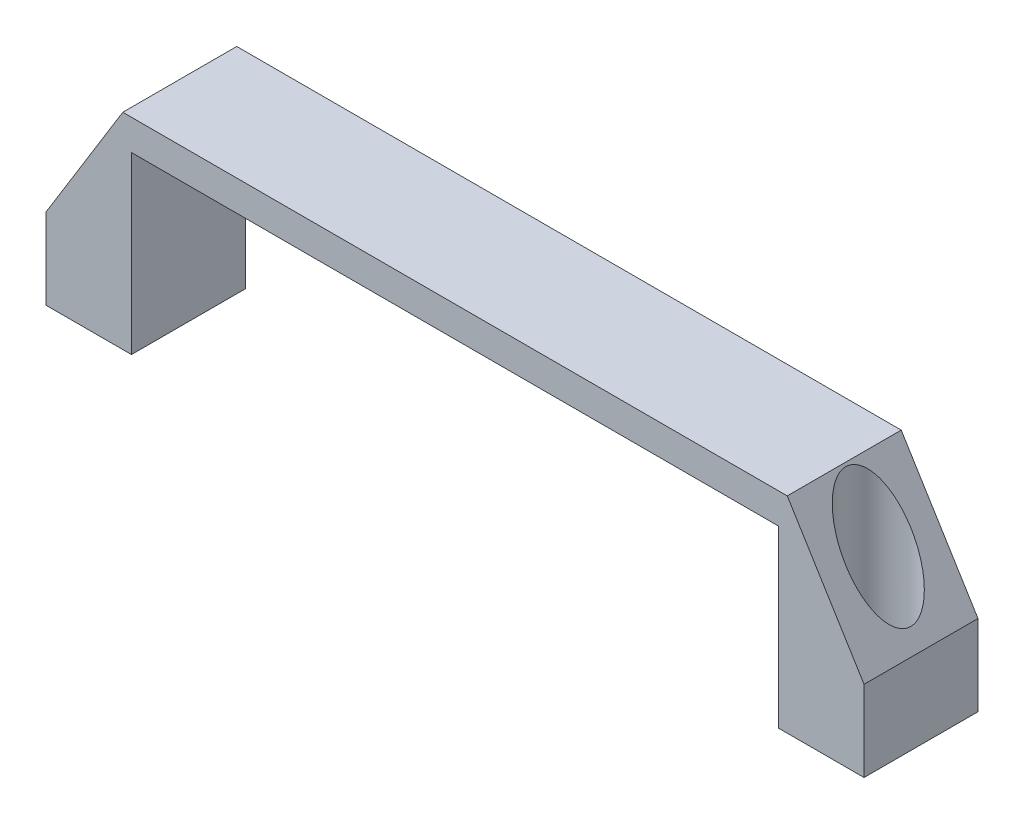
ISO-10303-21;
HEADER;
FILE_DESCRIPTION(('STEP AP214'),'2;1');
FILE_NAME('part.step','',(''),(''),'','','');
FILE_SCHEMA(('AUTOMOTIVE_DESIGN { 1 0 10303 214 1 1 1 1 }'));
ENDSEC;
DATA;
#1=APPLICATION_CONTEXT('core data for automotive mechanical design processes');
#2=APPLICATION_PROTOCOL_DEFINITION('international standard','automotive_design',2000,#1);
#3=PRODUCT_CONTEXT('',#1,'mechanical');
#4=PRODUCT('Part','Part','',(#3));
#5=PRODUCT_RELATED_PRODUCT_CATEGORY('part','',(#4));
#6=PRODUCT_DEFINITION_FORMATION('','',#4);
#7=PRODUCT_DEFINITION_CONTEXT('part definition',#1,'design');
#8=PRODUCT_DEFINITION('design','',#6,#7);
#9=PRODUCT_DEFINITION_SHAPE('','',#8);
#10=(LENGTH_UNIT() NAMED_UNIT(*) SI_UNIT(.MILLI.,.METRE.));
#11=(NAMED_UNIT(*) PLANE_ANGLE_UNIT() SI_UNIT($,.RADIAN.));
#12=(NAMED_UNIT(*) SI_UNIT($,.STERADIAN.) SOLID_ANGLE_UNIT());
#13=UNCERTAINTY_MEASURE_WITH_UNIT(LENGTH_MEASURE(1.E-05),#10,'distance_accuracy_value','');
#14=(GEOMETRIC_REPRESENTATION_CONTEXT(3) GLOBAL_UNCERTAINTY_ASSIGNED_CONTEXT((#13)) GLOBAL_UNIT_ASSIGNED_CONTEXT((#10,
#11,#12)) REPRESENTATION_CONTEXT('',''));
#15=CARTESIAN_POINT('',(0.,0.,0.));
#16=DIRECTION('',(0.,0.,1.));
#17=DIRECTION('',(1.,0.,0.));
#18=AXIS2_PLACEMENT_3D('',#15,#16,#17);
#19=CARTESIAN_POINT('',(-90.,7.50834742871663,0.));
#20=DIRECTION('',(0.,-1.,0.));
#21=DIRECTION('',(0.,0.,-1.));
#22=AXIS2_PLACEMENT_3D('',#19,#20,#21);
#23=CYLINDRICAL_SURFACE('',#22,4.25000000000001);
#24=CARTESIAN_POINT('',(-90.,-42.9916525712834,0.));
#25=DIRECTION('',(0.,-1.,0.));
#26=DIRECTION('',(0.,0.,-1.));
#27=AXIS2_PLACEMENT_3D('',#24,#25,#26);
#28=CIRCLE('',#27,4.25000000000001);
#29=CARTESIAN_POINT('',(-90.,-42.9916525712834,-4.25000000000001));
#30=VERTEX_POINT('',#29);
#31=EDGE_CURVE('E149',#30,#30,#28,.T.);
#32=ORIENTED_EDGE('',*,*,#31,.T.);
#33=EDGE_LOOP('',(#32));
#34=FACE_BOUND('',#33,.T.);
#35=CARTESIAN_POINT('',(-90.,-38.4916525712834,0.));
#36=DIRECTION('',(0.,1.,0.));
#37=DIRECTION('',(-1.,0.,0.));
#38=AXIS2_PLACEMENT_3D('',#35,#36,#37);
#39=CIRCLE('',#38,4.25000000000001);
#40=CARTESIAN_POINT('',(-94.25,-38.4916525712834,0.));
#41=VERTEX_POINT('',#40);
#42=EDGE_CURVE('E182',#41,#41,#39,.F.);
#43=ORIENTED_EDGE('',*,*,#42,.F.);
#44=EDGE_LOOP('',(#43));
#45=FACE_BOUND('',#44,.T.);
#46=ADVANCED_FACE('F34',(#34,#45),#23,.F.);
#47=CARTESIAN_POINT('',(-100.5,-42.9916525712834,14.));
#48=DIRECTION('',(1.,0.,0.));
#49=DIRECTION('',(0.,0.,-1.));
#50=AXIS2_PLACEMENT_3D('',#47,#48,#49);
#51=PLANE('',#50);
#52=DIRECTION('',(0.,-1.,0.));
#53=VECTOR('',#52,1.);
#54=CARTESIAN_POINT('',(-100.5,-42.9916525712834,-14.));
#55=LINE('',#54,#53);
#56=CARTESIAN_POINT('',(-100.5,-23.1511573142438,-14.));
#57=VERTEX_POINT('',#56);
#58=CARTESIAN_POINT('',(-100.5,-42.9916525712834,-14.));
#59=VERTEX_POINT('',#58);
#60=EDGE_CURVE('E145',#57,#59,#55,.T.);
#61=ORIENTED_EDGE('',*,*,#60,.T.);
#62=DIRECTION('',(0.,0.,-1.));
#63=VECTOR('',#62,1.);
#64=CARTESIAN_POINT('',(-100.5,-42.9916525712834,14.));
#65=LINE('',#64,#63);
#66=CARTESIAN_POINT('',(-100.5,-42.9916525712834,14.));
#67=VERTEX_POINT('',#66);
#68=EDGE_CURVE('E11',#67,#59,#65,.T.);
#69=ORIENTED_EDGE('',*,*,#68,.F.);
#70=DIRECTION('',(0.,-1.,0.));
#71=VECTOR('',#70,1.);
#72=CARTESIAN_POINT('',(-100.5,-42.9916525712834,14.));
#73=LINE('',#72,#71);
#74=CARTESIAN_POINT('',(-100.5,-23.1511573142438,14.));
#75=VERTEX_POINT('',#74);
#76=EDGE_CURVE('E164',#75,#67,#73,.T.);
#77=ORIENTED_EDGE('',*,*,#76,.F.);
#78=DIRECTION('',(0.,0.,-1.));
#79=VECTOR('',#78,1.);
#80=CARTESIAN_POINT('',(-100.5,-23.1511573142438,14.));
#81=LINE('',#80,#79);
#82=EDGE_CURVE('E141',#75,#57,#81,.T.);
#83=ORIENTED_EDGE('',*,*,#82,.T.);
#84=EDGE_LOOP('',(#61,#69,#77,#83));
#85=FACE_BOUND('',#84,.T.);
#86=ADVANCED_FACE('F36',(#85),#51,.F.);
#87=CARTESIAN_POINT('',(-100.5,-42.9916525712834,14.));
#88=DIRECTION('',(0.,1.,0.));
#89=DIRECTION('',(0.,0.,1.));
#90=AXIS2_PLACEMENT_3D('',#87,#88,#89);
#91=PLANE('',#90);
#92=ORIENTED_EDGE('',*,*,#31,.F.);
#93=EDGE_LOOP('',(#92));
#94=FACE_BOUND('',#93,.T.);
#95=DIRECTION('',(1.,0.,0.));
#96=VECTOR('',#95,1.);
#97=CARTESIAN_POINT('',(-100.5,-42.9916525712834,-14.));
#98=LINE('',#97,#96);
#99=CARTESIAN_POINT('',(-79.5,-42.9916525712834,-14.));
#100=VERTEX_POINT('',#99);
#101=EDGE_CURVE('E148',#59,#100,#98,.T.);
#102=ORIENTED_EDGE('',*,*,#101,.T.);
#103=DIRECTION('',(0.,0.,-1.));
#104=VECTOR('',#103,1.);
#105=CARTESIAN_POINT('',(-79.5,-42.9916525712834,14.));
#106=LINE('',#105,#104);
#107=CARTESIAN_POINT('',(-79.5,-42.9916525712834,14.));
#108=VERTEX_POINT('',#107);
#109=EDGE_CURVE('E44',#108,#100,#106,.T.);
#110=ORIENTED_EDGE('',*,*,#109,.F.);
#111=DIRECTION('',(1.,0.,0.));
#112=VECTOR('',#111,1.);
#113=CARTESIAN_POINT('',(-100.5,-42.9916525712834,14.));
#114=LINE('',#113,#112);
#115=EDGE_CURVE('E102',#67,#108,#114,.T.);
#116=ORIENTED_EDGE('',*,*,#115,.F.);
#117=ORIENTED_EDGE('',*,*,#68,.T.);
#118=EDGE_LOOP('',(#102,#110,#116,#117));
#119=FACE_BOUND('',#118,.T.);
#120=ADVANCED_FACE('F249',(#94,#119),#91,.F.);
#121=CARTESIAN_POINT('',(-79.5,-42.9916525712834,14.));
#122=DIRECTION('',(-1.,0.,0.));
#123=DIRECTION('',(0.,0.,1.));
#124=AXIS2_PLACEMENT_3D('',#121,#122,#123);
#125=PLANE('',#124);
#126=DIRECTION('',(0.,1.,0.));
#127=VECTOR('',#126,1.);
#128=CARTESIAN_POINT('',(-79.5,-42.9916525712834,-14.));
#129=LINE('',#128,#127);
#130=CARTESIAN_POINT('',(-79.5,0.00834742871660965,-14.));
#131=VERTEX_POINT('',#130);
#132=EDGE_CURVE('E151',#100,#131,#129,.T.);
#133=ORIENTED_EDGE('',*,*,#132,.T.);
#134=DIRECTION('',(0.,0.,-1.));
#135=VECTOR('',#134,1.);
#136=CARTESIAN_POINT('',(-79.5,0.00834742871660965,14.));
#137=LINE('',#136,#135);
#138=CARTESIAN_POINT('',(-79.5,0.00834742871660965,14.));
#139=VERTEX_POINT('',#138);
#140=EDGE_CURVE('E177',#139,#131,#137,.T.);
#141=ORIENTED_EDGE('',*,*,#140,.F.);
#142=DIRECTION('',(0.,1.,0.));
#143=VECTOR('',#142,1.);
#144=CARTESIAN_POINT('',(-79.5,-42.9916525712834,14.));
#145=LINE('',#144,#143);
#146=EDGE_CURVE('E208',#108,#139,#145,.T.);
#147=ORIENTED_EDGE('',*,*,#146,.F.);
#148=ORIENTED_EDGE('',*,*,#109,.T.);
#149=EDGE_LOOP('',(#133,#141,#147,#148));
#150=FACE_BOUND('',#149,.T.);
#151=ADVANCED_FACE('F282',(#150),#125,.F.);
#152=CARTESIAN_POINT('',(-79.5,0.00834742871660965,14.));
#153=DIRECTION('',(0.,1.,0.));
#154=DIRECTION('',(-1.,0.,0.));
#155=AXIS2_PLACEMENT_3D('',#152,#153,#154);
#156=PLANE('',#155);
#157=DIRECTION('',(1.,0.,0.));
#158=VECTOR('',#157,1.);
#159=CARTESIAN_POINT('',(-79.5,0.00834742871660965,-14.));
#160=LINE('',#159,#158);
#161=CARTESIAN_POINT('',(79.5,0.00834742871662912,-14.));
#162=VERTEX_POINT('',#161);
#163=EDGE_CURVE('E153',#131,#162,#160,.T.);
#164=ORIENTED_EDGE('',*,*,#163,.T.);
#165=DIRECTION('',(0.,0.,-1.));
#166=VECTOR('',#165,1.);
#167=CARTESIAN_POINT('',(79.5,0.00834742871662912,14.));
#168=LINE('',#167,#166);
#169=CARTESIAN_POINT('',(79.5,0.00834742871662912,14.));
#170=VERTEX_POINT('',#169);
#171=EDGE_CURVE('E174',#170,#162,#168,.T.);
#172=ORIENTED_EDGE('',*,*,#171,.F.);
#173=DIRECTION('',(1.,0.,0.));
#174=VECTOR('',#173,1.);
#175=CARTESIAN_POINT('',(-79.5,0.00834742871660965,14.));
#176=LINE('',#175,#174);
#177=EDGE_CURVE('E210',#139,#170,#176,.T.);
#178=ORIENTED_EDGE('',*,*,#177,.F.);
#179=ORIENTED_EDGE('',*,*,#140,.T.);
#180=EDGE_LOOP('',(#164,#172,#178,#179));
#181=FACE_BOUND('',#180,.T.);
#182=ADVANCED_FACE('F275',(#181),#156,.F.);
#183=CARTESIAN_POINT('',(79.5,-42.9916525712834,14.));
#184=DIRECTION('',(1.,0.,0.));
#185=DIRECTION('',(0.,1.,0.));
#186=AXIS2_PLACEMENT_3D('',#183,#184,#185);
#187=PLANE('',#186);
#188=DIRECTION('',(0.,-1.,0.));
#189=VECTOR('',#188,1.);
#190=CARTESIAN_POINT('',(79.5,-42.9916525712834,-14.));
#191=LINE('',#190,#189);
#192=CARTESIAN_POINT('',(79.5,-42.9916525712834,-14.));
#193=VERTEX_POINT('',#192);
#194=EDGE_CURVE('E155',#162,#193,#191,.T.);
#195=ORIENTED_EDGE('',*,*,#194,.T.);
#196=DIRECTION('',(0.,0.,-1.));
#197=VECTOR('',#196,1.);
#198=CARTESIAN_POINT('',(79.5,-42.9916525712834,14.));
#199=LINE('',#198,#197);
#200=CARTESIAN_POINT('',(79.5,-42.9916525712834,14.));
#201=VERTEX_POINT('',#200);
#202=EDGE_CURVE('E171',#201,#193,#199,.T.);
#203=ORIENTED_EDGE('',*,*,#202,.F.);
#204=DIRECTION('',(0.,-1.,0.));
#205=VECTOR('',#204,1.);
#206=CARTESIAN_POINT('',(79.5,-42.9916525712834,14.));
#207=LINE('',#206,#205);
#208=EDGE_CURVE('E212',#170,#201,#207,.T.);
#209=ORIENTED_EDGE('',*,*,#208,.F.);
#210=ORIENTED_EDGE('',*,*,#171,.T.);
#211=EDGE_LOOP('',(#195,#203,#209,#210));
#212=FACE_BOUND('',#211,.T.);
#213=ADVANCED_FACE('F268',(#212),#187,.F.);
#214=CARTESIAN_POINT('',(100.5,-42.9916525712834,14.));
#215=DIRECTION('',(0.,1.,0.));
#216=DIRECTION('',(-1.,0.,0.));
#217=AXIS2_PLACEMENT_3D('',#214,#215,#216);
#218=PLANE('',#217);
#219=CARTESIAN_POINT('',(90.,-42.9916525712834,0.));
#220=DIRECTION('',(0.,-1.,0.));
#221=DIRECTION('',(0.,0.,1.));
#222=AXIS2_PLACEMENT_3D('',#219,#220,#221);
#223=CIRCLE('',#222,4.25000000000001);
#224=CARTESIAN_POINT('',(90.,-42.9916525712834,4.25000000000001));
#225=VERTEX_POINT('',#224);
#226=EDGE_CURVE('E188',#225,#225,#223,.T.);
#227=ORIENTED_EDGE('',*,*,#226,.F.);
#228=EDGE_LOOP('',(#227));
#229=FACE_BOUND('',#228,.T.);
#230=DIRECTION('',(1.,0.,0.));
#231=VECTOR('',#230,1.);
#232=CARTESIAN_POINT('',(100.5,-42.9916525712834,-14.));
#233=LINE('',#232,#231);
#234=CARTESIAN_POINT('',(100.5,-42.9916525712834,-14.));
#235=VERTEX_POINT('',#234);
#236=EDGE_CURVE('E157',#193,#235,#233,.T.);
#237=ORIENTED_EDGE('',*,*,#236,.T.);
#238=DIRECTION('',(0.,0.,-1.));
#239=VECTOR('',#238,1.);
#240=CARTESIAN_POINT('',(100.5,-42.9916525712834,14.));
#241=LINE('',#240,#239);
#242=CARTESIAN_POINT('',(100.5,-42.9916525712834,14.));
#243=VERTEX_POINT('',#242);
#244=EDGE_CURVE('E168',#243,#235,#241,.T.);
#245=ORIENTED_EDGE('',*,*,#244,.F.);
#246=DIRECTION('',(1.,0.,0.));
#247=VECTOR('',#246,1.);
#248=CARTESIAN_POINT('',(100.5,-42.9916525712834,14.));
#249=LINE('',#248,#247);
#250=EDGE_CURVE('E214',#201,#243,#249,.T.);
#251=ORIENTED_EDGE('',*,*,#250,.F.);
#252=ORIENTED_EDGE('',*,*,#202,.T.);
#253=EDGE_LOOP('',(#237,#245,#251,#252));
#254=FACE_BOUND('',#253,.T.);
#255=ADVANCED_FACE('F220',(#229,#254),#218,.F.);
#256=CARTESIAN_POINT('',(100.5,-42.9916525712834,14.));
#257=DIRECTION('',(-1.,0.,0.));
#258=DIRECTION('',(0.,0.,1.));
#259=AXIS2_PLACEMENT_3D('',#256,#257,#258);
#260=PLANE('',#259);
#261=DIRECTION('',(0.,1.,0.));
#262=VECTOR('',#261,1.);
#263=CARTESIAN_POINT('',(100.5,-42.9916525712834,-14.));
#264=LINE('',#263,#262);
#265=CARTESIAN_POINT('',(100.5,-23.1511573142438,-14.));
#266=VERTEX_POINT('',#265);
#267=EDGE_CURVE('E159',#235,#266,#264,.T.);
#268=ORIENTED_EDGE('',*,*,#267,.T.);
#269=DIRECTION('',(0.,0.,-1.));
#270=VECTOR('',#269,1.);
#271=CARTESIAN_POINT('',(100.5,-23.1511573142438,14.));
#272=LINE('',#271,#270);
#273=CARTESIAN_POINT('',(100.5,-23.1511573142438,14.));
#274=VERTEX_POINT('',#273);
#275=EDGE_CURVE('E136',#274,#266,#272,.T.);
#276=ORIENTED_EDGE('',*,*,#275,.F.);
#277=DIRECTION('',(0.,1.,0.));
#278=VECTOR('',#277,1.);
#279=CARTESIAN_POINT('',(100.5,-42.9916525712834,14.));
#280=LINE('',#279,#278);
#281=EDGE_CURVE('E127',#243,#274,#280,.T.);
#282=ORIENTED_EDGE('',*,*,#281,.F.);
#283=ORIENTED_EDGE('',*,*,#244,.T.);
#284=EDGE_LOOP('',(#268,#276,#282,#283));
#285=FACE_BOUND('',#284,.T.);
#286=ADVANCED_FACE('F224',(#285),#260,.F.);
#287=CARTESIAN_POINT('',(100.5,-23.1511573142438,14.));
#288=DIRECTION('',(-0.851652909526679,-0.524106212226818,0.));
#289=DIRECTION('',(0.524106212226818,-0.851652909526679,0.));
#290=AXIS2_PLACEMENT_3D('',#287,#288,#289);
#291=PLANE('',#290);
#292=CARTESIAN_POINT('',(90.,-6.08905169249215,0.));
#293=DIRECTION('',(-0.851652909526679,-0.524106212226818,0.));
#294=DIRECTION('',(-0.524106212226818,0.851652909526679,0.));
#295=AXIS2_PLACEMENT_3D('',#292,#293,#294);
#296=ELLIPSE('',#295,15.2640816181317,8.00000000000001);
#297=CARTESIAN_POINT('',(82.,6.91064782884242,0.));
#298=VERTEX_POINT('',#297);
#299=EDGE_CURVE('E38',#298,#298,#296,.T.);
#300=ORIENTED_EDGE('',*,*,#299,.T.);
#301=EDGE_LOOP('',(#300));
#302=FACE_BOUND('',#301,.T.);
#303=DIRECTION('',(-0.524106212226818,0.851652909526679,0.));
#304=VECTOR('',#303,1.);
#305=CARTESIAN_POINT('',(100.5,-23.1511573142438,-14.));
#306=LINE('',#305,#304);
#307=CARTESIAN_POINT('',(81.6321763598346,7.50834742871663,-14.));
#308=VERTEX_POINT('',#307);
#309=EDGE_CURVE('E135',#266,#308,#306,.T.);
#310=ORIENTED_EDGE('',*,*,#309,.T.);
#311=DIRECTION('',(0.,0.,-1.));
#312=VECTOR('',#311,1.);
#313=CARTESIAN_POINT('',(81.6321763598346,7.50834742871663,14.));
#314=LINE('',#313,#312);
#315=CARTESIAN_POINT('',(81.6321763598346,7.50834742871663,14.));
#316=VERTEX_POINT('',#315);
#317=EDGE_CURVE('E132',#316,#308,#314,.T.);
#318=ORIENTED_EDGE('',*,*,#317,.F.);
#319=DIRECTION('',(-0.524106212226818,0.851652909526679,0.));
#320=VECTOR('',#319,1.);
#321=CARTESIAN_POINT('',(100.5,-23.1511573142438,14.));
#322=LINE('',#321,#320);
#323=EDGE_CURVE('E121',#274,#316,#322,.T.);
#324=ORIENTED_EDGE('',*,*,#323,.F.);
#325=ORIENTED_EDGE('',*,*,#275,.T.);
#326=EDGE_LOOP('',(#310,#318,#324,#325));
#327=FACE_BOUND('',#326,.T.);
#328=ADVANCED_FACE('F133',(#302,#327),#291,.F.);
#329=CARTESIAN_POINT('',(-81.6321763598346,7.50834742871661,14.));
#330=DIRECTION('',(0.,-1.,0.));
#331=DIRECTION('',(1.,0.,0.));
#332=AXIS2_PLACEMENT_3D('',#329,#330,#331);
#333=PLANE('',#332);
#334=DIRECTION('',(-1.,0.,0.));
#335=VECTOR('',#334,1.);
#336=CARTESIAN_POINT('',(-81.6321763598346,7.50834742871661,-14.));
#337=LINE('',#336,#335);
#338=CARTESIAN_POINT('',(-81.6321763598346,7.50834742871661,-14.));
#339=VERTEX_POINT('',#338);
#340=EDGE_CURVE('E88',#308,#339,#337,.T.);
#341=ORIENTED_EDGE('',*,*,#340,.T.);
#342=DIRECTION('',(0.,0.,-1.));
#343=VECTOR('',#342,1.);
#344=CARTESIAN_POINT('',(-81.6321763598346,7.50834742871661,14.));
#345=LINE('',#344,#343);
#346=CARTESIAN_POINT('',(-81.6321763598346,7.50834742871661,14.));
#347=VERTEX_POINT('',#346);
#348=EDGE_CURVE('E137',#347,#339,#345,.T.);
#349=ORIENTED_EDGE('',*,*,#348,.F.);
#350=DIRECTION('',(-1.,0.,0.));
#351=VECTOR('',#350,1.);
#352=CARTESIAN_POINT('',(-81.6321763598346,7.50834742871661,14.));
#353=LINE('',#352,#351);
#354=EDGE_CURVE('E125',#316,#347,#353,.T.);
#355=ORIENTED_EDGE('',*,*,#354,.F.);
#356=ORIENTED_EDGE('',*,*,#317,.T.);
#357=EDGE_LOOP('',(#341,#349,#355,#356));
#358=FACE_BOUND('',#357,.T.);
#359=ADVANCED_FACE('F139',(#358),#333,.F.);
#360=CARTESIAN_POINT('',(-100.5,-23.1511573142438,14.));
#361=DIRECTION('',(0.851652909526679,-0.524106212226817,0.));
#362=DIRECTION('',(0.524106212226818,0.851652909526679,0.));
#363=AXIS2_PLACEMENT_3D('',#360,#361,#362);
#364=PLANE('',#363);
#365=CARTESIAN_POINT('',(-90.,-6.08905169249221,0.));
#366=DIRECTION('',(0.851652909526679,-0.524106212226817,0.));
#367=DIRECTION('',(0.524106212226818,0.851652909526679,0.));
#368=AXIS2_PLACEMENT_3D('',#365,#366,#367);
#369=ELLIPSE('',#368,15.2640816181317,8.00000000000001);
#370=CARTESIAN_POINT('',(-82.,6.91064782884238,0.));
#371=VERTEX_POINT('',#370);
#372=EDGE_CURVE('E185',#371,#371,#369,.T.);
#373=ORIENTED_EDGE('',*,*,#372,.T.);
#374=EDGE_LOOP('',(#373));
#375=FACE_BOUND('',#374,.T.);
#376=DIRECTION('',(-0.524106212226817,-0.851652909526679,0.));
#377=VECTOR('',#376,1.);
#378=CARTESIAN_POINT('',(-100.5,-23.1511573142438,-14.));
#379=LINE('',#378,#377);
#380=EDGE_CURVE('E94',#339,#57,#379,.T.);
#381=ORIENTED_EDGE('',*,*,#380,.T.);
#382=ORIENTED_EDGE('',*,*,#82,.F.);
#383=DIRECTION('',(-0.524106212226817,-0.851652909526679,0.));
#384=VECTOR('',#383,1.);
#385=CARTESIAN_POINT('',(-100.5,-23.1511573142438,14.));
#386=LINE('',#385,#384);
#387=EDGE_CURVE('E53',#347,#75,#386,.T.);
#388=ORIENTED_EDGE('',*,*,#387,.F.);
#389=ORIENTED_EDGE('',*,*,#348,.T.);
#390=EDGE_LOOP('',(#381,#382,#388,#389));
#391=FACE_BOUND('',#390,.T.);
#392=ADVANCED_FACE('F232',(#375,#391),#364,.F.);
#393=CARTESIAN_POINT('',(0.,0.,14.));
#394=DIRECTION('',(0.,0.,-1.));
#395=DIRECTION('',(-1.,0.,0.));
#396=AXIS2_PLACEMENT_3D('',#393,#394,#395);
#397=PLANE('',#396);
#398=ORIENTED_EDGE('',*,*,#76,.T.);
#399=ORIENTED_EDGE('',*,*,#115,.T.);
#400=ORIENTED_EDGE('',*,*,#146,.T.);
#401=ORIENTED_EDGE('',*,*,#177,.T.);
#402=ORIENTED_EDGE('',*,*,#208,.T.);
#403=ORIENTED_EDGE('',*,*,#250,.T.);
#404=ORIENTED_EDGE('',*,*,#281,.T.);
#405=ORIENTED_EDGE('',*,*,#323,.T.);
#406=ORIENTED_EDGE('',*,*,#354,.T.);
#407=ORIENTED_EDGE('',*,*,#387,.T.);
#408=EDGE_LOOP('',(#398,#399,#400,#401,#402,#403,#404,#405,#406,#407));
#409=FACE_BOUND('',#408,.T.);
#410=ADVANCED_FACE('F123',(#409),#397,.F.);
#411=CARTESIAN_POINT('',(0.,0.,-14.));
#412=DIRECTION('',(0.,0.,-1.));
#413=DIRECTION('',(-1.,0.,0.));
#414=AXIS2_PLACEMENT_3D('',#411,#412,#413);
#415=PLANE('',#414);
#416=ORIENTED_EDGE('',*,*,#60,.F.);
#417=ORIENTED_EDGE('',*,*,#380,.F.);
#418=ORIENTED_EDGE('',*,*,#340,.F.);
#419=ORIENTED_EDGE('',*,*,#309,.F.);
#420=ORIENTED_EDGE('',*,*,#267,.F.);
#421=ORIENTED_EDGE('',*,*,#236,.F.);
#422=ORIENTED_EDGE('',*,*,#194,.F.);
#423=ORIENTED_EDGE('',*,*,#163,.F.);
#424=ORIENTED_EDGE('',*,*,#132,.F.);
#425=ORIENTED_EDGE('',*,*,#101,.F.);
#426=EDGE_LOOP('',(#416,#417,#418,#419,#420,#421,#422,#423,#424,#425));
#427=FACE_BOUND('',#426,.T.);
#428=ADVANCED_FACE('F227',(#427),#415,.T.);
#429=CARTESIAN_POINT('',(90.,7.50834742871663,0.));
#430=DIRECTION('',(0.,-1.,0.));
#431=DIRECTION('',(0.,0.,-1.));
#432=AXIS2_PLACEMENT_3D('',#429,#430,#431);
#433=CYLINDRICAL_SURFACE('',#432,4.25000000000001);
#434=CARTESIAN_POINT('',(90.,-38.4916525712834,0.));
#435=DIRECTION('',(0.,-1.,0.));
#436=DIRECTION('',(1.,0.,0.));
#437=AXIS2_PLACEMENT_3D('',#434,#435,#436);
#438=CIRCLE('',#437,4.25000000000001);
#439=CARTESIAN_POINT('',(94.25,-38.4916525712834,0.));
#440=VERTEX_POINT('',#439);
#441=EDGE_CURVE('E189',#440,#440,#438,.F.);
#442=ORIENTED_EDGE('',*,*,#441,.T.);
#443=EDGE_LOOP('',(#442));
#444=FACE_BOUND('',#443,.T.);
#445=ORIENTED_EDGE('',*,*,#226,.T.);
#446=EDGE_LOOP('',(#445));
#447=FACE_BOUND('',#446,.T.);
#448=ADVANCED_FACE('F252',(#444,#447),#433,.F.);
#449=CARTESIAN_POINT('',(-90.,-38.4916525712834,0.));
#450=DIRECTION('',(0.,1.,0.));
#451=DIRECTION('',(-1.,0.,0.));
#452=AXIS2_PLACEMENT_3D('',#449,#450,#451);
#453=CYLINDRICAL_SURFACE('',#452,8.00000000000001);
#454=CARTESIAN_POINT('',(-90.,-38.4916525712834,0.));
#455=DIRECTION('',(0.,1.,0.));
#456=DIRECTION('',(-1.,0.,0.));
#457=AXIS2_PLACEMENT_3D('',#454,#455,#456);
#458=CIRCLE('',#457,8.00000000000001);
#459=CARTESIAN_POINT('',(-98.,-38.4916525712834,0.));
#460=VERTEX_POINT('',#459);
#461=EDGE_CURVE('E186',#460,#460,#458,.T.);
#462=ORIENTED_EDGE('',*,*,#461,.F.);
#463=EDGE_LOOP('',(#462));
#464=FACE_BOUND('',#463,.T.);
#465=ORIENTED_EDGE('',*,*,#372,.F.);
#466=EDGE_LOOP('',(#465));
#467=FACE_BOUND('',#466,.T.);
#468=ADVANCED_FACE('F258',(#464,#467),#453,.F.);
#469=CARTESIAN_POINT('',(-90.,-38.4916525712834,0.));
#470=DIRECTION('',(0.,1.,0.));
#471=DIRECTION('',(-1.,0.,0.));
#472=AXIS2_PLACEMENT_3D('',#469,#470,#471);
#473=PLANE('',#472);
#474=ORIENTED_EDGE('',*,*,#461,.T.);
#475=EDGE_LOOP('',(#474));
#476=FACE_BOUND('',#475,.T.);
#477=ORIENTED_EDGE('',*,*,#42,.T.);
#478=EDGE_LOOP('',(#477));
#479=FACE_BOUND('',#478,.T.);
#480=ADVANCED_FACE('F262',(#476,#479),#473,.T.);
#481=CARTESIAN_POINT('',(90.,-38.4916525712834,0.));
#482=DIRECTION('',(0.,1.,0.));
#483=DIRECTION('',(-1.,0.,0.));
#484=AXIS2_PLACEMENT_3D('',#481,#482,#483);
#485=CYLINDRICAL_SURFACE('',#484,8.00000000000001);
#486=CARTESIAN_POINT('',(90.,-38.4916525712834,0.));
#487=DIRECTION('',(0.,1.,0.));
#488=DIRECTION('',(1.,0.,0.));
#489=AXIS2_PLACEMENT_3D('',#486,#487,#488);
#490=CIRCLE('',#489,8.00000000000001);
#491=CARTESIAN_POINT('',(98.,-38.4916525712834,0.));
#492=VERTEX_POINT('',#491);
#493=EDGE_CURVE('E191',#492,#492,#490,.T.);
#494=ORIENTED_EDGE('',*,*,#493,.F.);
#495=EDGE_LOOP('',(#494));
#496=FACE_BOUND('',#495,.T.);
#497=ORIENTED_EDGE('',*,*,#299,.F.);
#498=EDGE_LOOP('',(#497));
#499=FACE_BOUND('',#498,.T.);
#500=ADVANCED_FACE('F361',(#496,#499),#485,.F.);
#501=CARTESIAN_POINT('',(90.,-38.4916525712834,0.));
#502=DIRECTION('',(0.,-1.,0.));
#503=DIRECTION('',(1.,0.,0.));
#504=AXIS2_PLACEMENT_3D('',#501,#502,#503);
#505=PLANE('',#504);
#506=ORIENTED_EDGE('',*,*,#493,.T.);
#507=EDGE_LOOP('',(#506));
#508=FACE_BOUND('',#507,.T.);
#509=ORIENTED_EDGE('',*,*,#441,.F.);
#510=EDGE_LOOP('',(#509));
#511=FACE_BOUND('',#510,.T.);
#512=ADVANCED_FACE('F370',(#508,#511),#505,.F.);
#513=CLOSED_SHELL('',(#46,#86,#120,#151,#182,#213,#255,#286,#328,#359,#392,#410,#428,#448,#468,
#480,#500,#512));
#514=MANIFOLD_SOLID_BREP('B2',#513);
#515=ADVANCED_BREP_SHAPE_REPRESENTATION('',(#18,#514),#14);
#516=SHAPE_DEFINITION_REPRESENTATION(#9,#515);
ENDSEC;
END-ISO-10303-21;
